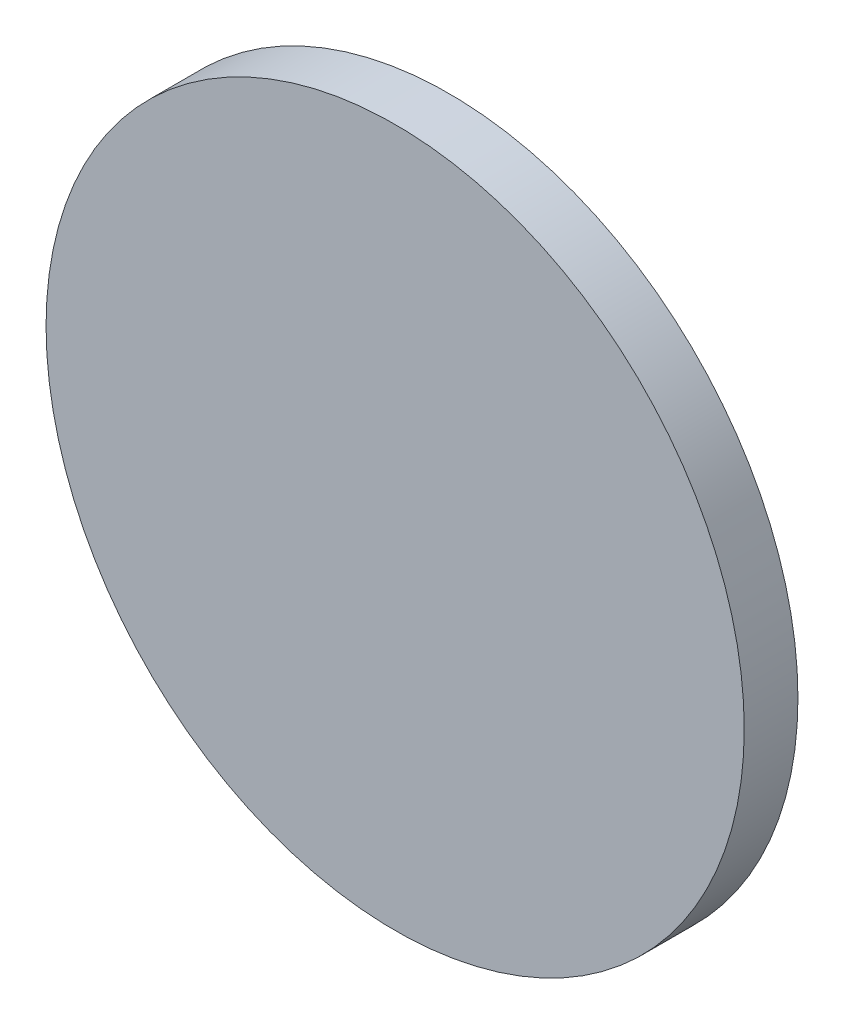
ISO-10303-21;
HEADER;
FILE_DESCRIPTION(('STEP AP214'),'2;1');
FILE_NAME('part.step','',(''),(''),'','','');
FILE_SCHEMA(('AUTOMOTIVE_DESIGN { 1 0 10303 214 1 1 1 1 }'));
ENDSEC;
DATA;
#1=APPLICATION_CONTEXT('core data for automotive mechanical design processes');
#2=APPLICATION_PROTOCOL_DEFINITION('international standard','automotive_design',2000,#1);
#3=PRODUCT_CONTEXT('',#1,'mechanical');
#4=PRODUCT('Part','Part','',(#3));
#5=PRODUCT_RELATED_PRODUCT_CATEGORY('part','',(#4));
#6=PRODUCT_DEFINITION_FORMATION('','',#4);
#7=PRODUCT_DEFINITION_CONTEXT('part definition',#1,'design');
#8=PRODUCT_DEFINITION('design','',#6,#7);
#9=PRODUCT_DEFINITION_SHAPE('','',#8);
#10=(LENGTH_UNIT() NAMED_UNIT(*) SI_UNIT(.MILLI.,.METRE.));
#11=(NAMED_UNIT(*) PLANE_ANGLE_UNIT() SI_UNIT($,.RADIAN.));
#12=(NAMED_UNIT(*) SI_UNIT($,.STERADIAN.) SOLID_ANGLE_UNIT());
#13=UNCERTAINTY_MEASURE_WITH_UNIT(LENGTH_MEASURE(1.E-05),#10,'distance_accuracy_value','');
#14=(GEOMETRIC_REPRESENTATION_CONTEXT(3) GLOBAL_UNCERTAINTY_ASSIGNED_CONTEXT((#13)) GLOBAL_UNIT_ASSIGNED_CONTEXT((#10,
#11,#12)) REPRESENTATION_CONTEXT('',''));
#15=CARTESIAN_POINT('',(0.,0.,0.));
#16=DIRECTION('',(0.,0.,1.));
#17=DIRECTION('',(1.,0.,0.));
#18=AXIS2_PLACEMENT_3D('',#15,#16,#17);
#19=CARTESIAN_POINT('',(0.,0.,2.));
#20=DIRECTION('',(0.,0.,-1.));
#21=DIRECTION('',(-1.,0.,0.));
#22=AXIS2_PLACEMENT_3D('',#19,#20,#21);
#23=CYLINDRICAL_SURFACE('',#22,13.);
#24=CARTESIAN_POINT('',(0.,0.,2.));
#25=DIRECTION('',(0.,0.,1.));
#26=DIRECTION('',(1.,0.,0.));
#27=AXIS2_PLACEMENT_3D('',#24,#25,#26);
#28=CIRCLE('',#27,13.);
#29=CARTESIAN_POINT('',(13.,0.,2.));
#30=VERTEX_POINT('',#29);
#31=EDGE_CURVE('E10',#30,#30,#28,.T.);
#32=ORIENTED_EDGE('',*,*,#31,.F.);
#33=EDGE_LOOP('',(#32));
#34=FACE_BOUND('',#33,.T.);
#35=CARTESIAN_POINT('',(0.,0.,0.));
#36=DIRECTION('',(0.,0.,1.));
#37=DIRECTION('',(1.,0.,0.));
#38=AXIS2_PLACEMENT_3D('',#35,#36,#37);
#39=CIRCLE('',#38,13.);
#40=CARTESIAN_POINT('',(13.,0.,0.));
#41=VERTEX_POINT('',#40);
#42=EDGE_CURVE('E36',#41,#41,#39,.T.);
#43=ORIENTED_EDGE('',*,*,#42,.T.);
#44=EDGE_LOOP('',(#43));
#45=FACE_BOUND('',#44,.T.);
#46=ADVANCED_FACE('F33',(#34,#45),#23,.T.);
#47=CARTESIAN_POINT('',(0.,0.,2.));
#48=DIRECTION('',(0.,0.,1.));
#49=DIRECTION('',(1.,0.,0.));
#50=AXIS2_PLACEMENT_3D('',#47,#48,#49);
#51=PLANE('',#50);
#52=ORIENTED_EDGE('',*,*,#31,.T.);
#53=EDGE_LOOP('',(#52));
#54=FACE_BOUND('',#53,.T.);
#55=ADVANCED_FACE('F48',(#54),#51,.T.);
#56=CARTESIAN_POINT('',(0.,0.,0.));
#57=DIRECTION('',(0.,0.,1.));
#58=DIRECTION('',(1.,0.,0.));
#59=AXIS2_PLACEMENT_3D('',#56,#57,#58);
#60=PLANE('',#59);
#61=ORIENTED_EDGE('',*,*,#42,.F.);
#62=EDGE_LOOP('',(#61));
#63=FACE_BOUND('',#62,.T.);
#64=ADVANCED_FACE('F46',(#63),#60,.F.);
#65=CLOSED_SHELL('',(#46,#55,#64));
#66=MANIFOLD_SOLID_BREP('B2',#65);
#67=ADVANCED_BREP_SHAPE_REPRESENTATION('',(#18,#66),#14);
#68=SHAPE_DEFINITION_REPRESENTATION(#9,#67);
ENDSEC;
END-ISO-10303-21;
